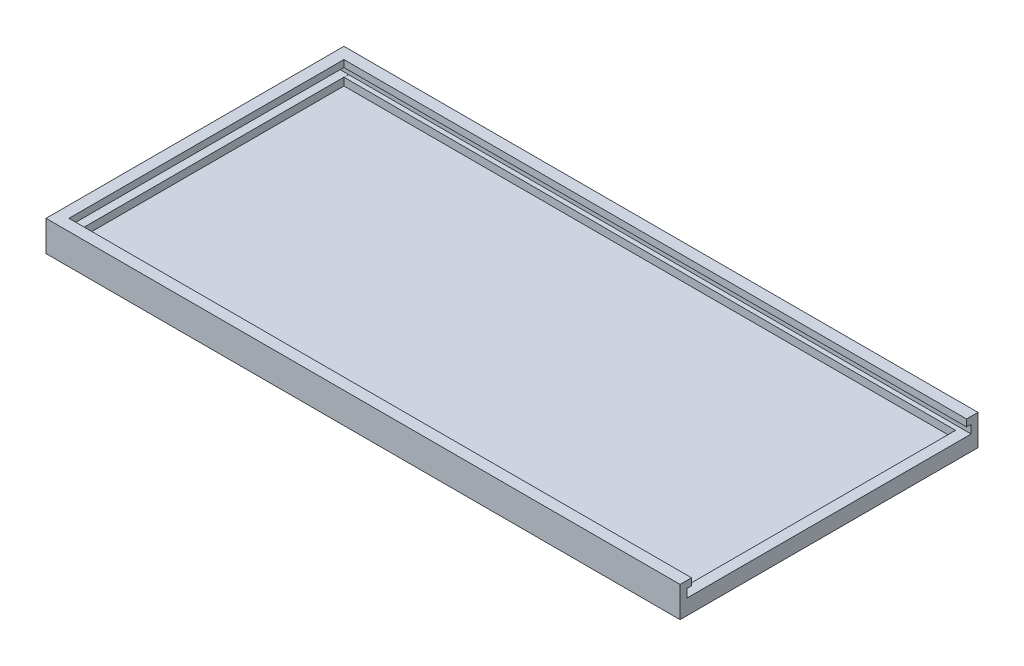
ISO-10303-21;
HEADER;
FILE_DESCRIPTION(('STEP AP214'),'2;1');
FILE_NAME('part.step','',(''),(''),'','','');
FILE_SCHEMA(('AUTOMOTIVE_DESIGN { 1 0 10303 214 1 1 1 1 }'));
ENDSEC;
DATA;
#1=APPLICATION_CONTEXT('core data for automotive mechanical design processes');
#2=APPLICATION_PROTOCOL_DEFINITION('international standard','automotive_design',2000,#1);
#3=PRODUCT_CONTEXT('',#1,'mechanical');
#4=PRODUCT('Part','Part','',(#3));
#5=PRODUCT_RELATED_PRODUCT_CATEGORY('part','',(#4));
#6=PRODUCT_DEFINITION_FORMATION('','',#4);
#7=PRODUCT_DEFINITION_CONTEXT('part definition',#1,'design');
#8=PRODUCT_DEFINITION('design','',#6,#7);
#9=PRODUCT_DEFINITION_SHAPE('','',#8);
#10=(LENGTH_UNIT() NAMED_UNIT(*) SI_UNIT(.MILLI.,.METRE.));
#11=(NAMED_UNIT(*) PLANE_ANGLE_UNIT() SI_UNIT($,.RADIAN.));
#12=(NAMED_UNIT(*) SI_UNIT($,.STERADIAN.) SOLID_ANGLE_UNIT());
#13=UNCERTAINTY_MEASURE_WITH_UNIT(LENGTH_MEASURE(1.E-05),#10,'distance_accuracy_value','');
#14=(GEOMETRIC_REPRESENTATION_CONTEXT(3) GLOBAL_UNCERTAINTY_ASSIGNED_CONTEXT((#13)) GLOBAL_UNIT_ASSIGNED_CONTEXT((#10,
#11,#12)) REPRESENTATION_CONTEXT('',''));
#15=CARTESIAN_POINT('',(0.,0.,0.));
#16=DIRECTION('',(0.,0.,1.));
#17=DIRECTION('',(1.,0.,0.));
#18=AXIS2_PLACEMENT_3D('',#15,#16,#17);
#19=CARTESIAN_POINT('',(2.99999999999999,2.,-3.));
#20=DIRECTION('',(0.,0.,1.));
#21=DIRECTION('',(1.,0.,0.));
#22=AXIS2_PLACEMENT_3D('',#19,#20,#21);
#23=PLANE('',#22);
#24=DIRECTION('',(0.,-1.,0.));
#25=VECTOR('',#24,1.);
#26=CARTESIAN_POINT('',(163.130934753439,4.,-3.));
#27=LINE('',#26,#25);
#28=CARTESIAN_POINT('',(163.130934753439,3.99999999999998,-3.));
#29=VERTEX_POINT('',#28);
#30=CARTESIAN_POINT('',(163.130934753439,2.,-3.));
#31=VERTEX_POINT('',#30);
#32=EDGE_CURVE('E54',#29,#31,#27,.T.);
#33=ORIENTED_EDGE('',*,*,#32,.T.);
#34=DIRECTION('',(1.,0.,0.));
#35=VECTOR('',#34,1.);
#36=CARTESIAN_POINT('',(2.99999999999999,2.,-3.));
#37=LINE('',#36,#35);
#38=CARTESIAN_POINT('',(2.99999999999999,2.,-3.));
#39=VERTEX_POINT('',#38);
#40=EDGE_CURVE('E222',#39,#31,#37,.T.);
#41=ORIENTED_EDGE('',*,*,#40,.F.);
#42=DIRECTION('',(0.,1.,0.));
#43=VECTOR('',#42,1.);
#44=CARTESIAN_POINT('',(2.99999999999999,2.,-3.));
#45=LINE('',#44,#43);
#46=CARTESIAN_POINT('',(2.99999999999999,4.,-3.));
#47=VERTEX_POINT('',#46);
#48=EDGE_CURVE('E251',#39,#47,#45,.T.);
#49=ORIENTED_EDGE('',*,*,#48,.T.);
#50=DIRECTION('',(-1.,0.,0.));
#51=VECTOR('',#50,1.);
#52=CARTESIAN_POINT('',(2.99999999999999,4.,-3.));
#53=LINE('',#52,#51);
#54=EDGE_CURVE('E373',#29,#47,#53,.T.);
#55=ORIENTED_EDGE('',*,*,#54,.F.);
#56=EDGE_LOOP('',(#33,#41,#49,#55));
#57=FACE_BOUND('',#56,.T.);
#58=ADVANCED_FACE('F38',(#57),#23,.F.);
#59=CARTESIAN_POINT('',(2.99999999999998,2.,-75.));
#60=DIRECTION('',(0.,0.,-1.));
#61=DIRECTION('',(-1.,0.,0.));
#62=AXIS2_PLACEMENT_3D('',#59,#60,#61);
#63=PLANE('',#62);
#64=DIRECTION('',(0.,-1.,0.));
#65=VECTOR('',#64,1.);
#66=CARTESIAN_POINT('',(163.130934753439,4.,-75.));
#67=LINE('',#66,#65);
#68=CARTESIAN_POINT('',(163.130934753439,4.,-75.));
#69=VERTEX_POINT('',#68);
#70=CARTESIAN_POINT('',(163.130934753439,2.,-75.));
#71=VERTEX_POINT('',#70);
#72=EDGE_CURVE('E173',#69,#71,#67,.T.);
#73=ORIENTED_EDGE('',*,*,#72,.F.);
#74=DIRECTION('',(1.,0.,0.));
#75=VECTOR('',#74,1.);
#76=CARTESIAN_POINT('',(3.,4.,-75.));
#77=LINE('',#76,#75);
#78=CARTESIAN_POINT('',(2.99999999999998,4.,-75.));
#79=VERTEX_POINT('',#78);
#80=EDGE_CURVE('E186',#79,#69,#77,.T.);
#81=ORIENTED_EDGE('',*,*,#80,.F.);
#82=DIRECTION('',(0.,1.,0.));
#83=VECTOR('',#82,1.);
#84=CARTESIAN_POINT('',(2.99999999999998,2.,-75.));
#85=LINE('',#84,#83);
#86=CARTESIAN_POINT('',(2.99999999999998,2.,-75.));
#87=VERTEX_POINT('',#86);
#88=EDGE_CURVE('E240',#87,#79,#85,.T.);
#89=ORIENTED_EDGE('',*,*,#88,.F.);
#90=DIRECTION('',(-1.,0.,0.));
#91=VECTOR('',#90,1.);
#92=CARTESIAN_POINT('',(2.99999999999998,2.,-75.));
#93=LINE('',#92,#91);
#94=EDGE_CURVE('E188',#71,#87,#93,.T.);
#95=ORIENTED_EDGE('',*,*,#94,.F.);
#96=EDGE_LOOP('',(#73,#81,#89,#95));
#97=FACE_BOUND('',#96,.T.);
#98=ADVANCED_FACE('F184',(#97),#63,.F.);
#99=CARTESIAN_POINT('',(0.,2.,0.));
#100=DIRECTION('',(0.,1.,0.));
#101=DIRECTION('',(0.,0.,1.));
#102=AXIS2_PLACEMENT_3D('',#99,#100,#101);
#103=PLANE('',#102);
#104=ORIENTED_EDGE('',*,*,#40,.T.);
#105=DIRECTION('',(0.,0.,1.));
#106=VECTOR('',#105,1.);
#107=CARTESIAN_POINT('',(163.130934753439,2.,-75.));
#108=LINE('',#107,#106);
#109=EDGE_CURVE('E179',#71,#31,#108,.T.);
#110=ORIENTED_EDGE('',*,*,#109,.F.);
#111=ORIENTED_EDGE('',*,*,#94,.T.);
#112=DIRECTION('',(0.,0.,1.));
#113=VECTOR('',#112,1.);
#114=CARTESIAN_POINT('',(2.99999999999998,2.,-75.));
#115=LINE('',#114,#113);
#116=EDGE_CURVE('E218',#87,#39,#115,.T.);
#117=ORIENTED_EDGE('',*,*,#116,.T.);
#118=EDGE_LOOP('',(#104,#110,#111,#117));
#119=FACE_BOUND('',#118,.T.);
#120=ADVANCED_FACE('F401',(#119),#103,.T.);
#121=CARTESIAN_POINT('',(2.99999999999998,2.,-75.));
#122=DIRECTION('',(-1.,0.,0.));
#123=DIRECTION('',(0.,0.,1.));
#124=AXIS2_PLACEMENT_3D('',#121,#122,#123);
#125=PLANE('',#124);
#126=DIRECTION('',(0.,-1.,0.));
#127=VECTOR('',#126,1.);
#128=CARTESIAN_POINT('',(3.,6.2,-76.2));
#129=LINE('',#128,#127);
#130=CARTESIAN_POINT('',(3.,4.01068830526531,-76.2));
#131=VERTEX_POINT('',#130);
#132=CARTESIAN_POINT('',(3.,4.,-76.2));
#133=VERTEX_POINT('',#132);
#134=EDGE_CURVE('E201',#131,#133,#129,.T.);
#135=ORIENTED_EDGE('',*,*,#134,.F.);
#136=DIRECTION('',(0.,0.,-1.));
#137=VECTOR('',#136,1.);
#138=CARTESIAN_POINT('',(2.99999999999998,4.01068830526532,-76.2));
#139=LINE('',#138,#137);
#140=CARTESIAN_POINT('',(2.99999999999999,4.01068830526531,-1.8));
#141=VERTEX_POINT('',#140);
#142=EDGE_CURVE('E341',#141,#131,#139,.T.);
#143=ORIENTED_EDGE('',*,*,#142,.F.);
#144=DIRECTION('',(0.,1.,0.));
#145=VECTOR('',#144,1.);
#146=CARTESIAN_POINT('',(2.99999999999999,6.2,-1.8));
#147=LINE('',#146,#145);
#148=CARTESIAN_POINT('',(2.99999999999999,4.,-1.8));
#149=VERTEX_POINT('',#148);
#150=EDGE_CURVE('E391',#149,#141,#147,.T.);
#151=ORIENTED_EDGE('',*,*,#150,.F.);
#152=DIRECTION('',(0.,0.,-1.));
#153=VECTOR('',#152,1.);
#154=CARTESIAN_POINT('',(2.99999999999999,4.,-1.8));
#155=LINE('',#154,#153);
#156=EDGE_CURVE('E350',#149,#47,#155,.T.);
#157=ORIENTED_EDGE('',*,*,#156,.T.);
#158=ORIENTED_EDGE('',*,*,#48,.F.);
#159=ORIENTED_EDGE('',*,*,#116,.F.);
#160=ORIENTED_EDGE('',*,*,#88,.T.);
#161=DIRECTION('',(0.,0.,1.));
#162=VECTOR('',#161,1.);
#163=CARTESIAN_POINT('',(3.,4.,-76.2));
#164=LINE('',#163,#162);
#165=EDGE_CURVE('E194',#133,#79,#164,.T.);
#166=ORIENTED_EDGE('',*,*,#165,.F.);
#167=EDGE_LOOP('',(#135,#143,#151,#157,#158,#159,#160,#166));
#168=FACE_BOUND('',#167,.T.);
#169=ADVANCED_FACE('F404',(#168),#125,.F.);
#170=CARTESIAN_POINT('',(2.99999999999998,6.2,-75.));
#171=VERTEX_POINT('',#170);
#172=CARTESIAN_POINT('',(2.99999999999998,8.,-75.));
#173=VERTEX_POINT('',#172);
#174=EDGE_CURVE('E244',#171,#173,#85,.T.);
#175=ORIENTED_EDGE('',*,*,#174,.F.);
#176=DIRECTION('',(-1.,0.,0.));
#177=VECTOR('',#176,1.);
#178=CARTESIAN_POINT('',(3.,6.2,-75.));
#179=LINE('',#178,#177);
#180=CARTESIAN_POINT('',(166.,6.2,-75.));
#181=VERTEX_POINT('',#180);
#182=EDGE_CURVE('E196',#181,#171,#179,.T.);
#183=ORIENTED_EDGE('',*,*,#182,.F.);
#184=DIRECTION('',(0.,1.,0.));
#185=VECTOR('',#184,1.);
#186=CARTESIAN_POINT('',(166.,2.,-75.));
#187=LINE('',#186,#185);
#188=CARTESIAN_POINT('',(166.,8.,-75.));
#189=VERTEX_POINT('',#188);
#190=EDGE_CURVE('E245',#181,#189,#187,.T.);
#191=ORIENTED_EDGE('',*,*,#190,.T.);
#192=DIRECTION('',(-1.,0.,0.));
#193=VECTOR('',#192,1.);
#194=CARTESIAN_POINT('',(2.99999999999998,8.,-75.));
#195=LINE('',#194,#193);
#196=EDGE_CURVE('E223',#189,#173,#195,.T.);
#197=ORIENTED_EDGE('',*,*,#196,.T.);
#198=EDGE_LOOP('',(#175,#183,#191,#197));
#199=FACE_BOUND('',#198,.T.);
#200=ADVANCED_FACE('F454',(#199),#63,.F.);
#201=CARTESIAN_POINT('',(0.,8.,0.));
#202=DIRECTION('',(1.,0.,0.));
#203=DIRECTION('',(0.,0.,-1.));
#204=AXIS2_PLACEMENT_3D('',#201,#202,#203);
#205=PLANE('',#204);
#206=DIRECTION('',(0.,0.,1.));
#207=VECTOR('',#206,1.);
#208=CARTESIAN_POINT('',(0.,0.,0.));
#209=LINE('',#208,#207);
#210=CARTESIAN_POINT('',(0.,0.,-78.));
#211=VERTEX_POINT('',#210);
#212=CARTESIAN_POINT('',(0.,0.,0.));
#213=VERTEX_POINT('',#212);
#214=EDGE_CURVE('E243',#211,#213,#209,.T.);
#215=ORIENTED_EDGE('',*,*,#214,.T.);
#216=DIRECTION('',(0.,-1.,0.));
#217=VECTOR('',#216,1.);
#218=CARTESIAN_POINT('',(0.,8.,0.));
#219=LINE('',#218,#217);
#220=CARTESIAN_POINT('',(0.,8.,0.));
#221=VERTEX_POINT('',#220);
#222=EDGE_CURVE('E11',#221,#213,#219,.T.);
#223=ORIENTED_EDGE('',*,*,#222,.F.);
#224=DIRECTION('',(0.,0.,1.));
#225=VECTOR('',#224,1.);
#226=CARTESIAN_POINT('',(0.,8.,0.));
#227=LINE('',#226,#225);
#228=CARTESIAN_POINT('',(0.,8.,-78.));
#229=VERTEX_POINT('',#228);
#230=EDGE_CURVE('E255',#229,#221,#227,.T.);
#231=ORIENTED_EDGE('',*,*,#230,.F.);
#232=DIRECTION('',(0.,-1.,0.));
#233=VECTOR('',#232,1.);
#234=CARTESIAN_POINT('',(0.,8.,-78.));
#235=LINE('',#234,#233);
#236=EDGE_CURVE('E271',#229,#211,#235,.T.);
#237=ORIENTED_EDGE('',*,*,#236,.T.);
#238=EDGE_LOOP('',(#215,#223,#231,#237));
#239=FACE_BOUND('',#238,.T.);
#240=ADVANCED_FACE('F40',(#239),#205,.F.);
#241=CARTESIAN_POINT('',(0.,8.,0.));
#242=DIRECTION('',(0.,0.,-1.));
#243=DIRECTION('',(-1.,0.,0.));
#244=AXIS2_PLACEMENT_3D('',#241,#242,#243);
#245=PLANE('',#244);
#246=DIRECTION('',(1.,0.,0.));
#247=VECTOR('',#246,1.);
#248=CARTESIAN_POINT('',(0.,0.,0.));
#249=LINE('',#248,#247);
#250=CARTESIAN_POINT('',(166.,0.,0.));
#251=VERTEX_POINT('',#250);
#252=EDGE_CURVE('E275',#213,#251,#249,.T.);
#253=ORIENTED_EDGE('',*,*,#252,.T.);
#254=DIRECTION('',(0.,-1.,0.));
#255=VECTOR('',#254,1.);
#256=CARTESIAN_POINT('',(166.,8.,0.));
#257=LINE('',#256,#255);
#258=CARTESIAN_POINT('',(166.,8.,0.));
#259=VERTEX_POINT('',#258);
#260=EDGE_CURVE('E47',#259,#251,#257,.T.);
#261=ORIENTED_EDGE('',*,*,#260,.F.);
#262=DIRECTION('',(1.,0.,0.));
#263=VECTOR('',#262,1.);
#264=CARTESIAN_POINT('',(0.,8.,0.));
#265=LINE('',#264,#263);
#266=EDGE_CURVE('E259',#221,#259,#265,.T.);
#267=ORIENTED_EDGE('',*,*,#266,.F.);
#268=ORIENTED_EDGE('',*,*,#222,.T.);
#269=EDGE_LOOP('',(#253,#261,#267,#268));
#270=FACE_BOUND('',#269,.T.);
#271=ADVANCED_FACE('F474',(#270),#245,.F.);
#272=CARTESIAN_POINT('',(166.,8.,0.));
#273=DIRECTION('',(-1.,0.,0.));
#274=DIRECTION('',(0.,0.,1.));
#275=AXIS2_PLACEMENT_3D('',#272,#273,#274);
#276=PLANE('',#275);
#277=DIRECTION('',(0.,0.,1.));
#278=VECTOR('',#277,1.);
#279=CARTESIAN_POINT('',(166.,4.,-76.2));
#280=LINE('',#279,#278);
#281=CARTESIAN_POINT('',(166.,4.,-76.2));
#282=VERTEX_POINT('',#281);
#283=CARTESIAN_POINT('',(166.,3.99999999999998,-1.8));
#284=VERTEX_POINT('',#283);
#285=EDGE_CURVE('E213',#282,#284,#280,.T.);
#286=ORIENTED_EDGE('',*,*,#285,.T.);
#287=DIRECTION('',(0.,-1.,0.));
#288=VECTOR('',#287,1.);
#289=CARTESIAN_POINT('',(166.,6.19999999999998,-1.8));
#290=LINE('',#289,#288);
#291=CARTESIAN_POINT('',(166.,6.19999999999998,-1.8));
#292=VERTEX_POINT('',#291);
#293=EDGE_CURVE('E383',#292,#284,#290,.T.);
#294=ORIENTED_EDGE('',*,*,#293,.F.);
#295=DIRECTION('',(0.,0.,-1.));
#296=VECTOR('',#295,1.);
#297=CARTESIAN_POINT('',(166.,6.19999999999998,-1.8));
#298=LINE('',#297,#296);
#299=CARTESIAN_POINT('',(166.,6.19999999999998,-3.));
#300=VERTEX_POINT('',#299);
#301=EDGE_CURVE('E365',#292,#300,#298,.T.);
#302=ORIENTED_EDGE('',*,*,#301,.T.);
#303=DIRECTION('',(0.,1.,0.));
#304=VECTOR('',#303,1.);
#305=CARTESIAN_POINT('',(166.,2.,-3.));
#306=LINE('',#305,#304);
#307=CARTESIAN_POINT('',(166.,8.,-3.));
#308=VERTEX_POINT('',#307);
#309=EDGE_CURVE('E248',#300,#308,#306,.T.);
#310=ORIENTED_EDGE('',*,*,#309,.T.);
#311=DIRECTION('',(0.,0.,-1.));
#312=VECTOR('',#311,1.);
#313=CARTESIAN_POINT('',(166.,8.,0.));
#314=LINE('',#313,#312);
#315=EDGE_CURVE('E264',#259,#308,#314,.T.);
#316=ORIENTED_EDGE('',*,*,#315,.F.);
#317=ORIENTED_EDGE('',*,*,#260,.T.);
#318=DIRECTION('',(0.,0.,-1.));
#319=VECTOR('',#318,1.);
#320=CARTESIAN_POINT('',(166.,0.,0.));
#321=LINE('',#320,#319);
#322=CARTESIAN_POINT('',(166.,0.,-78.));
#323=VERTEX_POINT('',#322);
#324=EDGE_CURVE('E278',#251,#323,#321,.T.);
#325=ORIENTED_EDGE('',*,*,#324,.T.);
#326=DIRECTION('',(0.,-1.,0.));
#327=VECTOR('',#326,1.);
#328=CARTESIAN_POINT('',(166.,8.,-78.));
#329=LINE('',#328,#327);
#330=CARTESIAN_POINT('',(166.,8.,-78.));
#331=VERTEX_POINT('',#330);
#332=EDGE_CURVE('E286',#331,#323,#329,.T.);
#333=ORIENTED_EDGE('',*,*,#332,.F.);
#334=EDGE_CURVE('E263',#189,#331,#314,.T.);
#335=ORIENTED_EDGE('',*,*,#334,.F.);
#336=ORIENTED_EDGE('',*,*,#190,.F.);
#337=DIRECTION('',(0.,0.,1.));
#338=VECTOR('',#337,1.);
#339=CARTESIAN_POINT('',(166.,6.2,-76.2));
#340=LINE('',#339,#338);
#341=CARTESIAN_POINT('',(166.,6.2,-76.2));
#342=VERTEX_POINT('',#341);
#343=EDGE_CURVE('E209',#342,#181,#340,.T.);
#344=ORIENTED_EDGE('',*,*,#343,.F.);
#345=DIRECTION('',(0.,1.,0.));
#346=VECTOR('',#345,1.);
#347=CARTESIAN_POINT('',(166.,6.2,-76.2));
#348=LINE('',#347,#346);
#349=EDGE_CURVE('E320',#282,#342,#348,.T.);
#350=ORIENTED_EDGE('',*,*,#349,.F.);
#351=EDGE_LOOP('',(#286,#294,#302,#310,#316,#317,#325,#333,#335,#336,#344,#350));
#352=FACE_BOUND('',#351,.T.);
#353=ADVANCED_FACE('F295',(#352),#276,.F.);
#354=CARTESIAN_POINT('',(0.,8.,-78.));
#355=DIRECTION('',(0.,0.,1.));
#356=DIRECTION('',(1.,0.,0.));
#357=AXIS2_PLACEMENT_3D('',#354,#355,#356);
#358=PLANE('',#357);
#359=DIRECTION('',(-1.,0.,0.));
#360=VECTOR('',#359,1.);
#361=CARTESIAN_POINT('',(0.,0.,-78.));
#362=LINE('',#361,#360);
#363=EDGE_CURVE('E260',#323,#211,#362,.T.);
#364=ORIENTED_EDGE('',*,*,#363,.T.);
#365=ORIENTED_EDGE('',*,*,#236,.F.);
#366=DIRECTION('',(-1.,0.,0.));
#367=VECTOR('',#366,1.);
#368=CARTESIAN_POINT('',(0.,8.,-78.));
#369=LINE('',#368,#367);
#370=EDGE_CURVE('E268',#331,#229,#369,.T.);
#371=ORIENTED_EDGE('',*,*,#370,.F.);
#372=ORIENTED_EDGE('',*,*,#332,.T.);
#373=EDGE_LOOP('',(#364,#365,#371,#372));
#374=FACE_BOUND('',#373,.T.);
#375=ADVANCED_FACE('F304',(#374),#358,.F.);
#376=CARTESIAN_POINT('',(0.,8.,0.));
#377=DIRECTION('',(0.,-1.,0.));
#378=DIRECTION('',(0.,0.,-1.));
#379=AXIS2_PLACEMENT_3D('',#376,#377,#378);
#380=PLANE('',#379);
#381=DIRECTION('',(0.,0.,1.));
#382=VECTOR('',#381,1.);
#383=CARTESIAN_POINT('',(2.99999999999998,8.,-75.));
#384=LINE('',#383,#382);
#385=CARTESIAN_POINT('',(2.99999999999999,8.,-3.));
#386=VERTEX_POINT('',#385);
#387=EDGE_CURVE('E212',#173,#386,#384,.T.);
#388=ORIENTED_EDGE('',*,*,#387,.F.);
#389=ORIENTED_EDGE('',*,*,#196,.F.);
#390=ORIENTED_EDGE('',*,*,#334,.T.);
#391=ORIENTED_EDGE('',*,*,#370,.T.);
#392=ORIENTED_EDGE('',*,*,#230,.T.);
#393=ORIENTED_EDGE('',*,*,#266,.T.);
#394=ORIENTED_EDGE('',*,*,#315,.T.);
#395=DIRECTION('',(1.,0.,0.));
#396=VECTOR('',#395,1.);
#397=CARTESIAN_POINT('',(2.99999999999999,8.,-3.));
#398=LINE('',#397,#396);
#399=EDGE_CURVE('E233',#386,#308,#398,.T.);
#400=ORIENTED_EDGE('',*,*,#399,.F.);
#401=EDGE_LOOP('',(#388,#389,#390,#391,#392,#393,#394,#400));
#402=FACE_BOUND('',#401,.T.);
#403=ADVANCED_FACE('F311',(#402),#380,.F.);
#404=CARTESIAN_POINT('',(0.,0.,0.));
#405=DIRECTION('',(0.,-1.,0.));
#406=DIRECTION('',(0.,0.,-1.));
#407=AXIS2_PLACEMENT_3D('',#404,#405,#406);
#408=PLANE('',#407);
#409=ORIENTED_EDGE('',*,*,#214,.F.);
#410=ORIENTED_EDGE('',*,*,#363,.F.);
#411=ORIENTED_EDGE('',*,*,#324,.F.);
#412=ORIENTED_EDGE('',*,*,#252,.F.);
#413=EDGE_LOOP('',(#409,#410,#411,#412));
#414=FACE_BOUND('',#413,.T.);
#415=ADVANCED_FACE('F301',(#414),#408,.T.);
#416=CARTESIAN_POINT('',(2.99999999999999,6.2,-3.));
#417=VERTEX_POINT('',#416);
#418=EDGE_CURVE('E229',#417,#386,#45,.T.);
#419=ORIENTED_EDGE('',*,*,#418,.F.);
#420=DIRECTION('',(0.,0.,1.));
#421=VECTOR('',#420,1.);
#422=CARTESIAN_POINT('',(2.99999999999998,6.2,-76.2));
#423=LINE('',#422,#421);
#424=EDGE_CURVE('E346',#171,#417,#423,.T.);
#425=ORIENTED_EDGE('',*,*,#424,.F.);
#426=ORIENTED_EDGE('',*,*,#174,.T.);
#427=ORIENTED_EDGE('',*,*,#387,.T.);
#428=EDGE_LOOP('',(#419,#425,#426,#427));
#429=FACE_BOUND('',#428,.T.);
#430=ADVANCED_FACE('F457',(#429),#125,.F.);
#431=ORIENTED_EDGE('',*,*,#309,.F.);
#432=DIRECTION('',(1.,0.,0.));
#433=VECTOR('',#432,1.);
#434=CARTESIAN_POINT('',(2.99999999999999,6.2,-3.));
#435=LINE('',#434,#433);
#436=EDGE_CURVE('E377',#417,#300,#435,.T.);
#437=ORIENTED_EDGE('',*,*,#436,.F.);
#438=ORIENTED_EDGE('',*,*,#418,.T.);
#439=ORIENTED_EDGE('',*,*,#399,.T.);
#440=EDGE_LOOP('',(#431,#437,#438,#439));
#441=FACE_BOUND('',#440,.T.);
#442=ADVANCED_FACE('F449',(#441),#23,.F.);
#443=CARTESIAN_POINT('',(3.,6.2,-76.2));
#444=DIRECTION('',(0.,1.,0.));
#445=DIRECTION('',(0.,0.,1.));
#446=AXIS2_PLACEMENT_3D('',#443,#444,#445);
#447=PLANE('',#446);
#448=ORIENTED_EDGE('',*,*,#182,.T.);
#449=ORIENTED_EDGE('',*,*,#424,.T.);
#450=ORIENTED_EDGE('',*,*,#436,.T.);
#451=ORIENTED_EDGE('',*,*,#301,.F.);
#452=DIRECTION('',(1.,0.,0.));
#453=VECTOR('',#452,1.);
#454=CARTESIAN_POINT('',(2.99999999999999,6.2,-1.8));
#455=LINE('',#454,#453);
#456=CARTESIAN_POINT('',(2.99999999999999,6.2,-1.8));
#457=VERTEX_POINT('',#456);
#458=EDGE_CURVE('E387',#457,#292,#455,.T.);
#459=ORIENTED_EDGE('',*,*,#458,.F.);
#460=CARTESIAN_POINT('',(2.99999999999999,6.19999999999999,-0.799999999999982));
#461=VERTEX_POINT('',#460);
#462=EDGE_CURVE('E347',#457,#461,#423,.T.);
#463=ORIENTED_EDGE('',*,*,#462,.T.);
#464=DIRECTION('',(1.,0.,0.));
#465=VECTOR('',#464,1.);
#466=CARTESIAN_POINT('',(0.799999999999992,6.19999999999999,-0.799999999999981));
#467=LINE('',#466,#465);
#468=CARTESIAN_POINT('',(0.799999999999992,6.19999999999999,-0.799999999999981));
#469=VERTEX_POINT('',#468);
#470=EDGE_CURVE('E329',#469,#461,#467,.T.);
#471=ORIENTED_EDGE('',*,*,#470,.F.);
#472=DIRECTION('',(0.,0.,1.));
#473=VECTOR('',#472,1.);
#474=CARTESIAN_POINT('',(0.799999999999981,6.2,-76.2));
#475=LINE('',#474,#473);
#476=CARTESIAN_POINT('',(0.799999999999981,6.2,-76.2));
#477=VERTEX_POINT('',#476);
#478=EDGE_CURVE('E358',#477,#469,#475,.T.);
#479=ORIENTED_EDGE('',*,*,#478,.F.);
#480=DIRECTION('',(-1.,0.,0.));
#481=VECTOR('',#480,1.);
#482=CARTESIAN_POINT('',(3.,6.2,-76.2));
#483=LINE('',#482,#481);
#484=EDGE_CURVE('E206',#342,#477,#483,.T.);
#485=ORIENTED_EDGE('',*,*,#484,.F.);
#486=ORIENTED_EDGE('',*,*,#343,.T.);
#487=EDGE_LOOP('',(#448,#449,#450,#451,#459,#463,#471,#479,#485,#486));
#488=FACE_BOUND('',#487,.T.);
#489=ADVANCED_FACE('F419',(#488),#447,.F.);
#490=CARTESIAN_POINT('',(3.,4.,-76.2));
#491=DIRECTION('',(0.,-1.,0.));
#492=DIRECTION('',(0.,0.,-1.));
#493=AXIS2_PLACEMENT_3D('',#490,#491,#492);
#494=PLANE('',#493);
#495=ORIENTED_EDGE('',*,*,#80,.T.);
#496=DIRECTION('',(0.,0.,1.));
#497=VECTOR('',#496,1.);
#498=CARTESIAN_POINT('',(163.130934753439,4.,-75.));
#499=LINE('',#498,#497);
#500=EDGE_CURVE('E170',#69,#29,#499,.T.);
#501=ORIENTED_EDGE('',*,*,#500,.T.);
#502=ORIENTED_EDGE('',*,*,#54,.T.);
#503=ORIENTED_EDGE('',*,*,#156,.F.);
#504=DIRECTION('',(-1.,0.,0.));
#505=VECTOR('',#504,1.);
#506=CARTESIAN_POINT('',(2.99999999999999,4.,-1.8));
#507=LINE('',#506,#505);
#508=EDGE_CURVE('E369',#284,#149,#507,.T.);
#509=ORIENTED_EDGE('',*,*,#508,.F.);
#510=ORIENTED_EDGE('',*,*,#285,.F.);
#511=DIRECTION('',(1.,0.,0.));
#512=VECTOR('',#511,1.);
#513=CARTESIAN_POINT('',(3.,4.,-76.2));
#514=LINE('',#513,#512);
#515=EDGE_CURVE('E322',#133,#282,#514,.T.);
#516=ORIENTED_EDGE('',*,*,#515,.F.);
#517=ORIENTED_EDGE('',*,*,#165,.T.);
#518=EDGE_LOOP('',(#495,#501,#502,#503,#509,#510,#516,#517));
#519=FACE_BOUND('',#518,.T.);
#520=ADVANCED_FACE('F191',(#519),#494,.F.);
#521=CARTESIAN_POINT('',(0.,0.,-76.2));
#522=DIRECTION('',(0.,0.,1.));
#523=DIRECTION('',(1.,0.,0.));
#524=AXIS2_PLACEMENT_3D('',#521,#522,#523);
#525=PLANE('',#524);
#526=ORIENTED_EDGE('',*,*,#484,.T.);
#527=DIRECTION('',(0.,1.,0.));
#528=VECTOR('',#527,1.);
#529=CARTESIAN_POINT('',(0.799999999999981,6.2,-76.2));
#530=LINE('',#529,#528);
#531=CARTESIAN_POINT('',(0.799999999999981,4.01068830526532,-76.2));
#532=VERTEX_POINT('',#531);
#533=EDGE_CURVE('E340',#532,#477,#530,.T.);
#534=ORIENTED_EDGE('',*,*,#533,.F.);
#535=DIRECTION('',(1.,0.,0.));
#536=VECTOR('',#535,1.);
#537=CARTESIAN_POINT('',(0.799999999999981,4.01068830526532,-76.2));
#538=LINE('',#537,#536);
#539=EDGE_CURVE('E62',#532,#131,#538,.T.);
#540=ORIENTED_EDGE('',*,*,#539,.T.);
#541=ORIENTED_EDGE('',*,*,#134,.T.);
#542=ORIENTED_EDGE('',*,*,#515,.T.);
#543=ORIENTED_EDGE('',*,*,#349,.T.);
#544=EDGE_LOOP('',(#526,#534,#540,#541,#542,#543));
#545=FACE_BOUND('',#544,.T.);
#546=ADVANCED_FACE('F416',(#545),#525,.T.);
#547=CARTESIAN_POINT('',(2.99999999999999,0.,0.));
#548=DIRECTION('',(-1.,0.,0.));
#549=DIRECTION('',(0.,0.,1.));
#550=AXIS2_PLACEMENT_3D('',#547,#548,#549);
#551=PLANE('',#550);
#552=EDGE_CURVE('E376',#141,#457,#147,.T.);
#553=ORIENTED_EDGE('',*,*,#552,.F.);
#554=CARTESIAN_POINT('',(2.99999999999999,4.01068830526531,-0.79999999999998));
#555=VERTEX_POINT('',#554);
#556=EDGE_CURVE('E336',#555,#141,#139,.T.);
#557=ORIENTED_EDGE('',*,*,#556,.F.);
#558=DIRECTION('',(0.,-1.,0.));
#559=VECTOR('',#558,1.);
#560=CARTESIAN_POINT('',(2.99999999999999,6.19999999999999,-0.799999999999982));
#561=LINE('',#560,#559);
#562=EDGE_CURVE('E342',#461,#555,#561,.T.);
#563=ORIENTED_EDGE('',*,*,#562,.F.);
#564=ORIENTED_EDGE('',*,*,#462,.F.);
#565=EDGE_LOOP('',(#553,#557,#563,#564));
#566=FACE_BOUND('',#565,.T.);
#567=ADVANCED_FACE('F435',(#566),#551,.T.);
#568=CARTESIAN_POINT('',(0.799999999999981,4.01068830526532,-76.2));
#569=DIRECTION('',(0.,-1.,0.));
#570=DIRECTION('',(0.,0.,-1.));
#571=AXIS2_PLACEMENT_3D('',#568,#569,#570);
#572=PLANE('',#571);
#573=ORIENTED_EDGE('',*,*,#556,.T.);
#574=ORIENTED_EDGE('',*,*,#142,.T.);
#575=ORIENTED_EDGE('',*,*,#539,.F.);
#576=DIRECTION('',(0.,0.,-1.));
#577=VECTOR('',#576,1.);
#578=CARTESIAN_POINT('',(0.799999999999981,4.01068830526532,-76.2));
#579=LINE('',#578,#577);
#580=CARTESIAN_POINT('',(0.799999999999992,4.01068830526531,-0.79999999999998));
#581=VERTEX_POINT('',#580);
#582=EDGE_CURVE('E333',#581,#532,#579,.T.);
#583=ORIENTED_EDGE('',*,*,#582,.F.);
#584=DIRECTION('',(1.,0.,0.));
#585=VECTOR('',#584,1.);
#586=CARTESIAN_POINT('',(0.799999999999992,4.01068830526531,-0.79999999999998));
#587=LINE('',#586,#585);
#588=EDGE_CURVE('E203',#581,#555,#587,.T.);
#589=ORIENTED_EDGE('',*,*,#588,.T.);
#590=EDGE_LOOP('',(#573,#574,#575,#583,#589));
#591=FACE_BOUND('',#590,.T.);
#592=ADVANCED_FACE('F426',(#591),#572,.F.);
#593=CARTESIAN_POINT('',(0.799999999999992,6.19999999999999,-0.799999999999981));
#594=DIRECTION('',(0.,0.,1.));
#595=DIRECTION('',(0.,-1.,0.));
#596=AXIS2_PLACEMENT_3D('',#593,#594,#595);
#597=PLANE('',#596);
#598=ORIENTED_EDGE('',*,*,#562,.T.);
#599=ORIENTED_EDGE('',*,*,#588,.F.);
#600=DIRECTION('',(0.,-1.,0.));
#601=VECTOR('',#600,1.);
#602=CARTESIAN_POINT('',(0.799999999999992,6.19999999999999,-0.799999999999981));
#603=LINE('',#602,#601);
#604=EDGE_CURVE('E354',#469,#581,#603,.T.);
#605=ORIENTED_EDGE('',*,*,#604,.F.);
#606=ORIENTED_EDGE('',*,*,#470,.T.);
#607=EDGE_LOOP('',(#598,#599,#605,#606));
#608=FACE_BOUND('',#607,.T.);
#609=ADVANCED_FACE('F437',(#608),#597,.F.);
#610=CARTESIAN_POINT('',(0.799999999999992,0.,0.));
#611=DIRECTION('',(-1.,0.,0.));
#612=DIRECTION('',(0.,0.,1.));
#613=AXIS2_PLACEMENT_3D('',#610,#611,#612);
#614=PLANE('',#613);
#615=ORIENTED_EDGE('',*,*,#533,.T.);
#616=ORIENTED_EDGE('',*,*,#478,.T.);
#617=ORIENTED_EDGE('',*,*,#604,.T.);
#618=ORIENTED_EDGE('',*,*,#582,.T.);
#619=EDGE_LOOP('',(#615,#616,#617,#618));
#620=FACE_BOUND('',#619,.T.);
#621=ADVANCED_FACE('F423',(#620),#614,.F.);
#622=CARTESIAN_POINT('',(0.,0.,-1.8));
#623=DIRECTION('',(0.,0.,1.));
#624=DIRECTION('',(1.,0.,0.));
#625=AXIS2_PLACEMENT_3D('',#622,#623,#624);
#626=PLANE('',#625);
#627=ORIENTED_EDGE('',*,*,#150,.T.);
#628=ORIENTED_EDGE('',*,*,#552,.T.);
#629=ORIENTED_EDGE('',*,*,#458,.T.);
#630=ORIENTED_EDGE('',*,*,#293,.T.);
#631=ORIENTED_EDGE('',*,*,#508,.T.);
#632=EDGE_LOOP('',(#627,#628,#629,#630,#631));
#633=FACE_BOUND('',#632,.T.);
#634=ADVANCED_FACE('F408',(#633),#626,.F.);
#635=CARTESIAN_POINT('',(163.130934753439,4.,-75.));
#636=DIRECTION('',(1.,0.,0.));
#637=DIRECTION('',(0.,0.,-1.));
#638=AXIS2_PLACEMENT_3D('',#635,#636,#637);
#639=PLANE('',#638);
#640=ORIENTED_EDGE('',*,*,#109,.T.);
#641=ORIENTED_EDGE('',*,*,#32,.F.);
#642=ORIENTED_EDGE('',*,*,#500,.F.);
#643=ORIENTED_EDGE('',*,*,#72,.T.);
#644=EDGE_LOOP('',(#640,#641,#642,#643));
#645=FACE_BOUND('',#644,.T.);
#646=ADVANCED_FACE('F172',(#645),#639,.F.);
#647=CLOSED_SHELL('',(#58,#98,#120,#169,#200,#240,#271,#353,#375,#403,#415,#430,#442,#489,#520,
#546,#567,#592,#609,#621,#634,#646));
#648=MANIFOLD_SOLID_BREP('B2',#647);
#649=ADVANCED_BREP_SHAPE_REPRESENTATION('',(#18,#648),#14);
#650=SHAPE_DEFINITION_REPRESENTATION(#9,#649);
ENDSEC;
END-ISO-10303-21;
